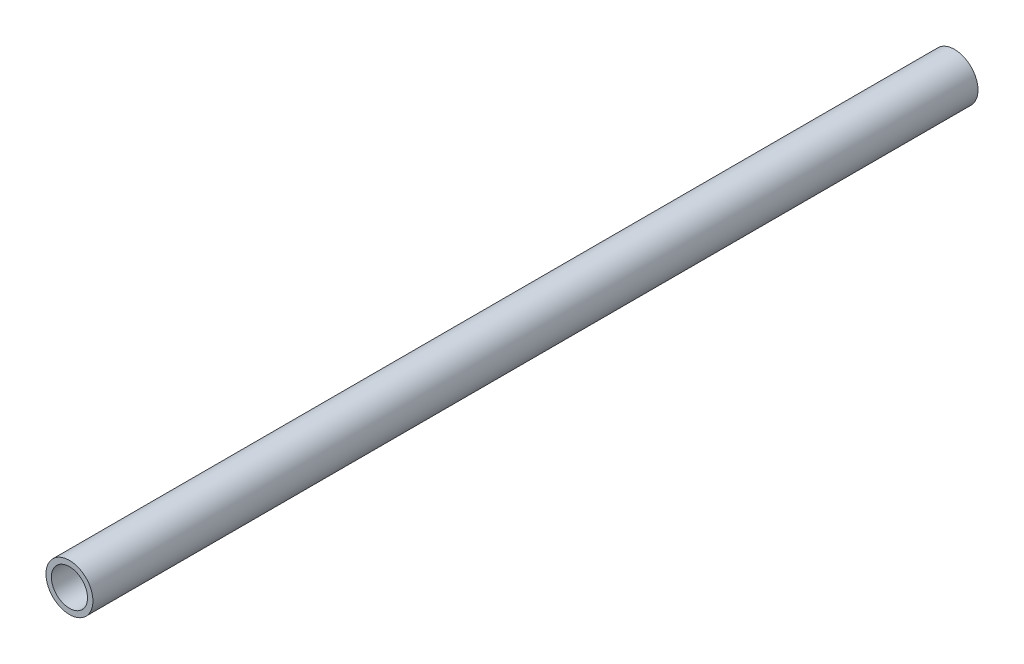
ISO-10303-21;
HEADER;
FILE_DESCRIPTION(('STEP AP214'),'2;1');
FILE_NAME('part.step','',(''),(''),'','','');
FILE_SCHEMA(('AUTOMOTIVE_DESIGN { 1 0 10303 214 1 1 1 1 }'));
ENDSEC;
DATA;
#1=APPLICATION_CONTEXT('core data for automotive mechanical design processes');
#2=APPLICATION_PROTOCOL_DEFINITION('international standard','automotive_design',2000,#1);
#3=PRODUCT_CONTEXT('',#1,'mechanical');
#4=PRODUCT('Part','Part','',(#3));
#5=PRODUCT_RELATED_PRODUCT_CATEGORY('part','',(#4));
#6=PRODUCT_DEFINITION_FORMATION('','',#4);
#7=PRODUCT_DEFINITION_CONTEXT('part definition',#1,'design');
#8=PRODUCT_DEFINITION('design','',#6,#7);
#9=PRODUCT_DEFINITION_SHAPE('','',#8);
#10=(LENGTH_UNIT() NAMED_UNIT(*) SI_UNIT(.MILLI.,.METRE.));
#11=(NAMED_UNIT(*) PLANE_ANGLE_UNIT() SI_UNIT($,.RADIAN.));
#12=(NAMED_UNIT(*) SI_UNIT($,.STERADIAN.) SOLID_ANGLE_UNIT());
#13=UNCERTAINTY_MEASURE_WITH_UNIT(LENGTH_MEASURE(1.E-05),#10,'distance_accuracy_value','');
#14=(GEOMETRIC_REPRESENTATION_CONTEXT(3) GLOBAL_UNCERTAINTY_ASSIGNED_CONTEXT((#13)) GLOBAL_UNIT_ASSIGNED_CONTEXT((#10,
#11,#12)) REPRESENTATION_CONTEXT('',''));
#15=CARTESIAN_POINT('',(0.,0.,0.));
#16=DIRECTION('',(0.,0.,1.));
#17=DIRECTION('',(1.,0.,0.));
#18=AXIS2_PLACEMENT_3D('',#15,#16,#17);
#19=CARTESIAN_POINT('',(0.,0.,245.));
#20=DIRECTION('',(0.,0.,1.));
#21=DIRECTION('',(1.,0.,0.));
#22=AXIS2_PLACEMENT_3D('',#19,#20,#21);
#23=PLANE('',#22);
#24=CARTESIAN_POINT('',(0.,0.,245.));
#25=DIRECTION('',(0.,0.,1.));
#26=DIRECTION('',(1.,0.,0.));
#27=AXIS2_PLACEMENT_3D('',#24,#25,#26);
#28=CIRCLE('',#27,6.5);
#29=CARTESIAN_POINT('',(6.5,0.,245.));
#30=VERTEX_POINT('',#29);
#31=EDGE_CURVE('E11',#30,#30,#28,.T.);
#32=ORIENTED_EDGE('',*,*,#31,.T.);
#33=EDGE_LOOP('',(#32));
#34=FACE_BOUND('',#33,.T.);
#35=CARTESIAN_POINT('',(0.,0.,245.));
#36=DIRECTION('',(0.,0.,1.));
#37=DIRECTION('',(1.,0.,0.));
#38=AXIS2_PLACEMENT_3D('',#35,#36,#37);
#39=CIRCLE('',#38,5.);
#40=CARTESIAN_POINT('',(5.,0.,245.));
#41=VERTEX_POINT('',#40);
#42=EDGE_CURVE('E56',#41,#41,#39,.T.);
#43=ORIENTED_EDGE('',*,*,#42,.F.);
#44=EDGE_LOOP('',(#43));
#45=FACE_BOUND('',#44,.T.);
#46=ADVANCED_FACE('F43',(#34,#45),#23,.T.);
#47=CARTESIAN_POINT('',(0.,0.,0.));
#48=DIRECTION('',(0.,0.,1.));
#49=DIRECTION('',(1.,0.,0.));
#50=AXIS2_PLACEMENT_3D('',#47,#48,#49);
#51=PLANE('',#50);
#52=CARTESIAN_POINT('',(0.,0.,0.));
#53=DIRECTION('',(0.,0.,1.));
#54=DIRECTION('',(1.,0.,0.));
#55=AXIS2_PLACEMENT_3D('',#52,#53,#54);
#56=CIRCLE('',#55,6.5);
#57=CARTESIAN_POINT('',(6.5,0.,0.));
#58=VERTEX_POINT('',#57);
#59=EDGE_CURVE('E47',#58,#58,#56,.T.);
#60=ORIENTED_EDGE('',*,*,#59,.F.);
#61=EDGE_LOOP('',(#60));
#62=FACE_BOUND('',#61,.T.);
#63=CARTESIAN_POINT('',(0.,0.,0.));
#64=DIRECTION('',(0.,0.,1.));
#65=DIRECTION('',(1.,0.,0.));
#66=AXIS2_PLACEMENT_3D('',#63,#64,#65);
#67=CIRCLE('',#66,5.);
#68=CARTESIAN_POINT('',(5.,0.,0.));
#69=VERTEX_POINT('',#68);
#70=EDGE_CURVE('E58',#69,#69,#67,.T.);
#71=ORIENTED_EDGE('',*,*,#70,.T.);
#72=EDGE_LOOP('',(#71));
#73=FACE_BOUND('',#72,.T.);
#74=ADVANCED_FACE('F70',(#62,#73),#51,.F.);
#75=CARTESIAN_POINT('',(0.,0.,245.));
#76=DIRECTION('',(0.,0.,-1.));
#77=DIRECTION('',(-1.,0.,0.));
#78=AXIS2_PLACEMENT_3D('',#75,#76,#77);
#79=CYLINDRICAL_SURFACE('',#78,6.5);
#80=ORIENTED_EDGE('',*,*,#31,.F.);
#81=EDGE_LOOP('',(#80));
#82=FACE_BOUND('',#81,.T.);
#83=ORIENTED_EDGE('',*,*,#59,.T.);
#84=EDGE_LOOP('',(#83));
#85=FACE_BOUND('',#84,.T.);
#86=ADVANCED_FACE('F45',(#82,#85),#79,.T.);
#87=CARTESIAN_POINT('',(0.,0.,245.));
#88=DIRECTION('',(0.,0.,-1.));
#89=DIRECTION('',(-1.,0.,0.));
#90=AXIS2_PLACEMENT_3D('',#87,#88,#89);
#91=CYLINDRICAL_SURFACE('',#90,5.);
#92=ORIENTED_EDGE('',*,*,#42,.T.);
#93=EDGE_LOOP('',(#92));
#94=FACE_BOUND('',#93,.T.);
#95=ORIENTED_EDGE('',*,*,#70,.F.);
#96=EDGE_LOOP('',(#95));
#97=FACE_BOUND('',#96,.T.);
#98=ADVANCED_FACE('F66',(#94,#97),#91,.F.);
#99=CLOSED_SHELL('',(#46,#74,#86,#98));
#100=MANIFOLD_SOLID_BREP('B2',#99);
#101=ADVANCED_BREP_SHAPE_REPRESENTATION('',(#18,#100),#14);
#102=SHAPE_DEFINITION_REPRESENTATION(#9,#101);
ENDSEC;
END-ISO-10303-21;
